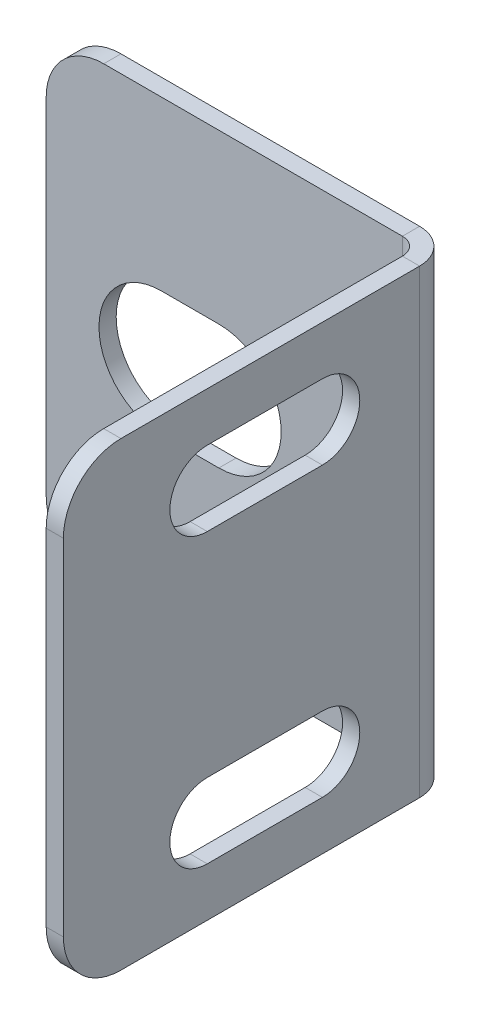
ISO-10303-21;
HEADER;
FILE_DESCRIPTION(('STEP AP214'),'2;1');
FILE_NAME('part.step','',(''),(''),'','','');
FILE_SCHEMA(('AUTOMOTIVE_DESIGN { 1 0 10303 214 1 1 1 1 }'));
ENDSEC;
DATA;
#1=APPLICATION_CONTEXT('core data for automotive mechanical design processes');
#2=APPLICATION_PROTOCOL_DEFINITION('international standard','automotive_design',2000,#1);
#3=PRODUCT_CONTEXT('',#1,'mechanical');
#4=PRODUCT('Part','Part','',(#3));
#5=PRODUCT_RELATED_PRODUCT_CATEGORY('part','',(#4));
#6=PRODUCT_DEFINITION_FORMATION('','',#4);
#7=PRODUCT_DEFINITION_CONTEXT('part definition',#1,'design');
#8=PRODUCT_DEFINITION('design','',#6,#7);
#9=PRODUCT_DEFINITION_SHAPE('','',#8);
#10=(LENGTH_UNIT() NAMED_UNIT(*) SI_UNIT(.MILLI.,.METRE.));
#11=(NAMED_UNIT(*) PLANE_ANGLE_UNIT() SI_UNIT($,.RADIAN.));
#12=(NAMED_UNIT(*) SI_UNIT($,.STERADIAN.) SOLID_ANGLE_UNIT());
#13=UNCERTAINTY_MEASURE_WITH_UNIT(LENGTH_MEASURE(1.E-05),#10,'distance_accuracy_value','');
#14=(GEOMETRIC_REPRESENTATION_CONTEXT(3) GLOBAL_UNCERTAINTY_ASSIGNED_CONTEXT((#13)) GLOBAL_UNIT_ASSIGNED_CONTEXT((#10,
#11,#12)) REPRESENTATION_CONTEXT('',''));
#15=CARTESIAN_POINT('',(0.,0.,0.));
#16=DIRECTION('',(0.,0.,1.));
#17=DIRECTION('',(1.,0.,0.));
#18=AXIS2_PLACEMENT_3D('',#15,#16,#17);
#19=CARTESIAN_POINT('',(-3.83615356006614,0.,4.54330643993387));
#20=DIRECTION('',(1.,0.,0.));
#21=DIRECTION('',(0.,0.,-1.));
#22=AXIS2_PLACEMENT_3D('',#19,#20,#21);
#23=PLANE('',#22);
#24=DIRECTION('',(0.,0.,1.));
#25=VECTOR('',#24,1.);
#26=CARTESIAN_POINT('',(-3.83615356006615,4.7,5.81330643993387));
#27=LINE('',#26,#25);
#28=CARTESIAN_POINT('',(-3.83615356006615,4.7,5.81330643993387));
#29=VERTEX_POINT('',#28);
#30=CARTESIAN_POINT('',(-3.83615356006616,4.7,10.8933064399339));
#31=VERTEX_POINT('',#30);
#32=EDGE_CURVE('E338',#29,#31,#27,.T.);
#33=ORIENTED_EDGE('',*,*,#32,.F.);
#34=CARTESIAN_POINT('',(-3.83615356006615,6.35,5.81330643993387));
#35=DIRECTION('',(-1.,0.,0.));
#36=DIRECTION('',(0.,0.,1.));
#37=AXIS2_PLACEMENT_3D('',#34,#35,#36);
#38=CIRCLE('',#37,1.65);
#39=CARTESIAN_POINT('',(-3.83615356006615,8.,5.81330643993387));
#40=VERTEX_POINT('',#39);
#41=EDGE_CURVE('E341',#40,#29,#38,.T.);
#42=ORIENTED_EDGE('',*,*,#41,.F.);
#43=DIRECTION('',(0.,0.,-1.));
#44=VECTOR('',#43,1.);
#45=CARTESIAN_POINT('',(-3.83615356006615,8.,5.81330643993387));
#46=LINE('',#45,#44);
#47=CARTESIAN_POINT('',(-3.83615356006616,8.,10.8933064399339));
#48=VERTEX_POINT('',#47);
#49=EDGE_CURVE('E344',#48,#40,#46,.T.);
#50=ORIENTED_EDGE('',*,*,#49,.F.);
#51=CARTESIAN_POINT('',(-3.83615356006616,6.35,10.8933064399339));
#52=DIRECTION('',(-1.,0.,0.));
#53=DIRECTION('',(0.,0.,1.));
#54=AXIS2_PLACEMENT_3D('',#51,#52,#53);
#55=CIRCLE('',#54,1.65);
#56=EDGE_CURVE('E347',#31,#48,#55,.T.);
#57=ORIENTED_EDGE('',*,*,#56,.F.);
#58=EDGE_LOOP('',(#33,#42,#50,#57));
#59=FACE_BOUND('',#58,.T.);
#60=DIRECTION('',(0.,0.,1.));
#61=VECTOR('',#60,1.);
#62=CARTESIAN_POINT('',(-3.83615356006614,-8.,5.81330643993386));
#63=LINE('',#62,#61);
#64=CARTESIAN_POINT('',(-3.83615356006614,-8.,5.81330643993386));
#65=VERTEX_POINT('',#64);
#66=CARTESIAN_POINT('',(-3.83615356006616,-8.,10.8933064399339));
#67=VERTEX_POINT('',#66);
#68=EDGE_CURVE('E326',#65,#67,#63,.T.);
#69=ORIENTED_EDGE('',*,*,#68,.F.);
#70=CARTESIAN_POINT('',(-3.83615356006614,-6.35,5.81330643993386));
#71=DIRECTION('',(-1.,0.,0.));
#72=DIRECTION('',(0.,0.,1.));
#73=AXIS2_PLACEMENT_3D('',#70,#71,#72);
#74=CIRCLE('',#73,1.65);
#75=CARTESIAN_POINT('',(-3.83615356006614,-4.7,5.81330643993387));
#76=VERTEX_POINT('',#75);
#77=EDGE_CURVE('E329',#76,#65,#74,.T.);
#78=ORIENTED_EDGE('',*,*,#77,.F.);
#79=DIRECTION('',(0.,0.,-1.));
#80=VECTOR('',#79,1.);
#81=CARTESIAN_POINT('',(-3.83615356006614,-4.7,5.81330643993387));
#82=LINE('',#81,#80);
#83=CARTESIAN_POINT('',(-3.83615356006616,-4.7,10.8933064399339));
#84=VERTEX_POINT('',#83);
#85=EDGE_CURVE('E332',#84,#76,#82,.T.);
#86=ORIENTED_EDGE('',*,*,#85,.F.);
#87=CARTESIAN_POINT('',(-3.83615356006616,-6.35,10.8933064399339));
#88=DIRECTION('',(-1.,0.,0.));
#89=DIRECTION('',(0.,0.,1.));
#90=AXIS2_PLACEMENT_3D('',#87,#88,#89);
#91=CIRCLE('',#90,1.65);
#92=EDGE_CURVE('E335',#67,#84,#91,.T.);
#93=ORIENTED_EDGE('',*,*,#92,.F.);
#94=EDGE_LOOP('',(#69,#78,#86,#93));
#95=FACE_BOUND('',#94,.T.);
#96=DIRECTION('',(0.,0.,-1.));
#97=VECTOR('',#96,1.);
#98=CARTESIAN_POINT('',(-3.83615356006619,10.16,17.2433064399339));
#99=LINE('',#98,#97);
#100=CARTESIAN_POINT('',(-3.83615356006618,10.16,14.7033064399339));
#101=VERTEX_POINT('',#100);
#102=CARTESIAN_POINT('',(-3.83615356006613,10.16,1.52146));
#103=VERTEX_POINT('',#102);
#104=EDGE_CURVE('E94',#101,#103,#99,.T.);
#105=ORIENTED_EDGE('',*,*,#104,.T.);
#106=DIRECTION('',(0.,-1.,0.));
#107=VECTOR('',#106,1.);
#108=CARTESIAN_POINT('',(-3.83615356006613,0.,1.52146));
#109=LINE('',#108,#107);
#110=CARTESIAN_POINT('',(-3.83615356006613,-10.16,1.52146));
#111=VERTEX_POINT('',#110);
#112=EDGE_CURVE('E275',#103,#111,#109,.T.);
#113=ORIENTED_EDGE('',*,*,#112,.T.);
#114=DIRECTION('',(0.,0.,1.));
#115=VECTOR('',#114,1.);
#116=CARTESIAN_POINT('',(-3.83615356006618,-10.16,17.2433064399339));
#117=LINE('',#116,#115);
#118=CARTESIAN_POINT('',(-3.83615356006618,-10.16,14.7033064399339));
#119=VERTEX_POINT('',#118);
#120=EDGE_CURVE('E350',#111,#119,#117,.T.);
#121=ORIENTED_EDGE('',*,*,#120,.T.);
#122=CARTESIAN_POINT('',(-3.83615356006618,-7.62,14.7033064399339));
#123=DIRECTION('',(1.,0.,0.));
#124=DIRECTION('',(0.,0.,-1.));
#125=AXIS2_PLACEMENT_3D('',#122,#123,#124);
#126=CIRCLE('',#125,2.54);
#127=CARTESIAN_POINT('',(-3.83615356006618,-7.62,17.2433064399339));
#128=VERTEX_POINT('',#127);
#129=EDGE_CURVE('E403',#119,#128,#126,.F.);
#130=ORIENTED_EDGE('',*,*,#129,.T.);
#131=DIRECTION('',(0.,1.,0.));
#132=VECTOR('',#131,1.);
#133=CARTESIAN_POINT('',(-3.83615356006619,10.16,17.2433064399339));
#134=LINE('',#133,#132);
#135=CARTESIAN_POINT('',(-3.83615356006619,7.62,17.2433064399339));
#136=VERTEX_POINT('',#135);
#137=EDGE_CURVE('E351',#128,#136,#134,.T.);
#138=ORIENTED_EDGE('',*,*,#137,.T.);
#139=CARTESIAN_POINT('',(-3.83615356006618,7.62,14.7033064399339));
#140=DIRECTION('',(1.,0.,0.));
#141=DIRECTION('',(0.,0.,-1.));
#142=AXIS2_PLACEMENT_3D('',#139,#140,#141);
#143=CIRCLE('',#142,2.54);
#144=EDGE_CURVE('E405',#136,#101,#143,.F.);
#145=ORIENTED_EDGE('',*,*,#144,.T.);
#146=EDGE_LOOP('',(#105,#113,#121,#130,#138,#145));
#147=FACE_BOUND('',#146,.T.);
#148=ADVANCED_FACE('F90',(#59,#95,#147),#23,.F.);
#149=CARTESIAN_POINT('',(-3.83615356006619,10.16,17.2433064399339));
#150=DIRECTION('',(0.,0.,-1.));
#151=DIRECTION('',(0.,1.,0.));
#152=AXIS2_PLACEMENT_3D('',#149,#150,#151);
#153=PLANE('',#152);
#154=DIRECTION('',(0.,1.,0.));
#155=VECTOR('',#154,1.);
#156=CARTESIAN_POINT('',(-3.07669356006619,0.,17.2433064399339));
#157=LINE('',#156,#155);
#158=CARTESIAN_POINT('',(-3.07669356006618,-7.62,17.2433064399339));
#159=VERTEX_POINT('',#158);
#160=CARTESIAN_POINT('',(-3.07669356006619,7.62,17.2433064399339));
#161=VERTEX_POINT('',#160);
#162=EDGE_CURVE('E379',#159,#161,#157,.T.);
#163=ORIENTED_EDGE('',*,*,#162,.T.);
#164=DIRECTION('',(1.,0.,0.));
#165=VECTOR('',#164,1.);
#166=CARTESIAN_POINT('',(-3.83615356006619,7.62,17.2433064399339));
#167=LINE('',#166,#165);
#168=EDGE_CURVE('E400',#161,#136,#167,.F.);
#169=ORIENTED_EDGE('',*,*,#168,.T.);
#170=ORIENTED_EDGE('',*,*,#137,.F.);
#171=DIRECTION('',(1.,0.,0.));
#172=VECTOR('',#171,1.);
#173=CARTESIAN_POINT('',(-3.83615356006618,-7.62,17.2433064399339));
#174=LINE('',#173,#172);
#175=EDGE_CURVE('E397',#128,#159,#174,.T.);
#176=ORIENTED_EDGE('',*,*,#175,.T.);
#177=EDGE_LOOP('',(#163,#169,#170,#176));
#178=FACE_BOUND('',#177,.T.);
#179=ADVANCED_FACE('F438',(#178),#153,.F.);
#180=CARTESIAN_POINT('',(-3.83615356006619,10.16,17.2433064399339));
#181=DIRECTION('',(0.,-1.,0.));
#182=DIRECTION('',(0.,0.,-1.));
#183=AXIS2_PLACEMENT_3D('',#180,#181,#182);
#184=PLANE('',#183);
#185=DIRECTION('',(1.,0.,0.));
#186=VECTOR('',#185,1.);
#187=CARTESIAN_POINT('',(-3.83615356006613,10.16,1.52146));
#188=LINE('',#187,#186);
#189=CARTESIAN_POINT('',(-3.07669356006613,10.16,1.52146000000001));
#190=VERTEX_POINT('',#189);
#191=EDGE_CURVE('E417',#103,#190,#188,.T.);
#192=ORIENTED_EDGE('',*,*,#191,.F.);
#193=ORIENTED_EDGE('',*,*,#104,.F.);
#194=DIRECTION('',(1.,0.,0.));
#195=VECTOR('',#194,1.);
#196=CARTESIAN_POINT('',(-3.83615356006618,10.16,14.7033064399339));
#197=LINE('',#196,#195);
#198=CARTESIAN_POINT('',(-3.07669356006618,10.16,14.7033064399339));
#199=VERTEX_POINT('',#198);
#200=EDGE_CURVE('E407',#101,#199,#197,.T.);
#201=ORIENTED_EDGE('',*,*,#200,.T.);
#202=DIRECTION('',(0.,0.,-1.));
#203=VECTOR('',#202,1.);
#204=CARTESIAN_POINT('',(-3.07669356006614,10.16,4.54330643993387));
#205=LINE('',#204,#203);
#206=EDGE_CURVE('E115',#199,#190,#205,.T.);
#207=ORIENTED_EDGE('',*,*,#206,.T.);
#208=EDGE_LOOP('',(#192,#193,#201,#207));
#209=FACE_BOUND('',#208,.T.);
#210=ADVANCED_FACE('F443',(#209),#184,.F.);
#211=CARTESIAN_POINT('',(-3.83615356006615,8.,5.81330643993387));
#212=DIRECTION('',(0.,-1.,0.));
#213=DIRECTION('',(0.,0.,-1.));
#214=AXIS2_PLACEMENT_3D('',#211,#212,#213);
#215=PLANE('',#214);
#216=DIRECTION('',(-1.,0.,0.));
#217=VECTOR('',#216,1.);
#218=CARTESIAN_POINT('',(-3.83615356006615,8.,5.81330643993387));
#219=LINE('',#218,#217);
#220=CARTESIAN_POINT('',(-3.07669356006615,8.,5.81330643993387));
#221=VERTEX_POINT('',#220);
#222=EDGE_CURVE('E395',#221,#40,#219,.T.);
#223=ORIENTED_EDGE('',*,*,#222,.F.);
#224=DIRECTION('',(0.,0.,-1.));
#225=VECTOR('',#224,1.);
#226=CARTESIAN_POINT('',(-3.07669356006614,8.,4.54330643993387));
#227=LINE('',#226,#225);
#228=CARTESIAN_POINT('',(-3.07669356006617,8.,10.8933064399339));
#229=VERTEX_POINT('',#228);
#230=EDGE_CURVE('E374',#229,#221,#227,.T.);
#231=ORIENTED_EDGE('',*,*,#230,.F.);
#232=DIRECTION('',(-1.,0.,0.));
#233=VECTOR('',#232,1.);
#234=CARTESIAN_POINT('',(-3.83615356006616,8.,10.8933064399339));
#235=LINE('',#234,#233);
#236=EDGE_CURVE('E393',#229,#48,#235,.T.);
#237=ORIENTED_EDGE('',*,*,#236,.T.);
#238=ORIENTED_EDGE('',*,*,#49,.T.);
#239=EDGE_LOOP('',(#223,#231,#237,#238));
#240=FACE_BOUND('',#239,.T.);
#241=ADVANCED_FACE('F525',(#240),#215,.T.);
#242=CARTESIAN_POINT('',(-3.83615356006616,6.35,10.8933064399339));
#243=DIRECTION('',(-1.,0.,0.));
#244=DIRECTION('',(0.,0.,1.));
#245=AXIS2_PLACEMENT_3D('',#242,#243,#244);
#246=CYLINDRICAL_SURFACE('',#245,1.65);
#247=ORIENTED_EDGE('',*,*,#236,.F.);
#248=CARTESIAN_POINT('',(-3.07669356006617,6.35,10.8933064399339));
#249=DIRECTION('',(-1.,0.,0.));
#250=DIRECTION('',(0.,0.,1.));
#251=AXIS2_PLACEMENT_3D('',#248,#249,#250);
#252=CIRCLE('',#251,1.65);
#253=CARTESIAN_POINT('',(-3.07669356006616,4.7,10.8933064399339));
#254=VERTEX_POINT('',#253);
#255=EDGE_CURVE('E371',#254,#229,#252,.T.);
#256=ORIENTED_EDGE('',*,*,#255,.F.);
#257=DIRECTION('',(-1.,0.,0.));
#258=VECTOR('',#257,1.);
#259=CARTESIAN_POINT('',(-3.83615356006616,4.7,10.8933064399339));
#260=LINE('',#259,#258);
#261=EDGE_CURVE('E391',#254,#31,#260,.T.);
#262=ORIENTED_EDGE('',*,*,#261,.T.);
#263=ORIENTED_EDGE('',*,*,#56,.T.);
#264=EDGE_LOOP('',(#247,#256,#262,#263));
#265=FACE_BOUND('',#264,.T.);
#266=ADVANCED_FACE('F548',(#265),#246,.F.);
#267=CARTESIAN_POINT('',(-3.83615356006615,4.7,5.81330643993387));
#268=DIRECTION('',(0.,1.,0.));
#269=DIRECTION('',(0.,0.,1.));
#270=AXIS2_PLACEMENT_3D('',#267,#268,#269);
#271=PLANE('',#270);
#272=ORIENTED_EDGE('',*,*,#261,.F.);
#273=DIRECTION('',(0.,0.,-1.));
#274=VECTOR('',#273,1.);
#275=CARTESIAN_POINT('',(-3.07669356006614,4.7,4.54330643993387));
#276=LINE('',#275,#274);
#277=CARTESIAN_POINT('',(-3.07669356006615,4.7,5.81330643993387));
#278=VERTEX_POINT('',#277);
#279=EDGE_CURVE('E362',#278,#254,#276,.F.);
#280=ORIENTED_EDGE('',*,*,#279,.F.);
#281=DIRECTION('',(-1.,0.,0.));
#282=VECTOR('',#281,1.);
#283=CARTESIAN_POINT('',(-3.83615356006615,4.7,5.81330643993387));
#284=LINE('',#283,#282);
#285=EDGE_CURVE('E389',#278,#29,#284,.T.);
#286=ORIENTED_EDGE('',*,*,#285,.T.);
#287=ORIENTED_EDGE('',*,*,#32,.T.);
#288=EDGE_LOOP('',(#272,#280,#286,#287));
#289=FACE_BOUND('',#288,.T.);
#290=ADVANCED_FACE('F552',(#289),#271,.T.);
#291=CARTESIAN_POINT('',(-3.83615356006614,-4.7,5.81330643993387));
#292=DIRECTION('',(0.,-1.,0.));
#293=DIRECTION('',(0.,0.,-1.));
#294=AXIS2_PLACEMENT_3D('',#291,#292,#293);
#295=PLANE('',#294);
#296=DIRECTION('',(-1.,0.,0.));
#297=VECTOR('',#296,1.);
#298=CARTESIAN_POINT('',(-3.83615356006614,-4.7,5.81330643993387));
#299=LINE('',#298,#297);
#300=CARTESIAN_POINT('',(-3.07669356006615,-4.7,5.81330643993387));
#301=VERTEX_POINT('',#300);
#302=EDGE_CURVE('E387',#301,#76,#299,.T.);
#303=ORIENTED_EDGE('',*,*,#302,.F.);
#304=DIRECTION('',(0.,0.,-1.));
#305=VECTOR('',#304,1.);
#306=CARTESIAN_POINT('',(-3.07669356006614,-4.7,4.54330643993387));
#307=LINE('',#306,#305);
#308=CARTESIAN_POINT('',(-3.07669356006616,-4.7,10.8933064399339));
#309=VERTEX_POINT('',#308);
#310=EDGE_CURVE('E363',#309,#301,#307,.T.);
#311=ORIENTED_EDGE('',*,*,#310,.F.);
#312=DIRECTION('',(-1.,0.,0.));
#313=VECTOR('',#312,1.);
#314=CARTESIAN_POINT('',(-3.83615356006616,-4.7,10.8933064399339));
#315=LINE('',#314,#313);
#316=EDGE_CURVE('E384',#309,#84,#315,.T.);
#317=ORIENTED_EDGE('',*,*,#316,.T.);
#318=ORIENTED_EDGE('',*,*,#85,.T.);
#319=EDGE_LOOP('',(#303,#311,#317,#318));
#320=FACE_BOUND('',#319,.T.);
#321=ADVANCED_FACE('F555',(#320),#295,.T.);
#322=CARTESIAN_POINT('',(-3.83615356006616,-6.35,10.8933064399339));
#323=DIRECTION('',(-1.,0.,0.));
#324=DIRECTION('',(0.,0.,1.));
#325=AXIS2_PLACEMENT_3D('',#322,#323,#324);
#326=CYLINDRICAL_SURFACE('',#325,1.65);
#327=ORIENTED_EDGE('',*,*,#316,.F.);
#328=CARTESIAN_POINT('',(-3.07669356006616,-6.35,10.8933064399339));
#329=DIRECTION('',(-1.,0.,0.));
#330=DIRECTION('',(0.,0.,1.));
#331=AXIS2_PLACEMENT_3D('',#328,#329,#330);
#332=CIRCLE('',#331,1.65);
#333=CARTESIAN_POINT('',(-3.07669356006616,-8.,10.8933064399339));
#334=VERTEX_POINT('',#333);
#335=EDGE_CURVE('E359',#334,#309,#332,.T.);
#336=ORIENTED_EDGE('',*,*,#335,.F.);
#337=DIRECTION('',(-1.,0.,0.));
#338=VECTOR('',#337,1.);
#339=CARTESIAN_POINT('',(-3.83615356006616,-8.,10.8933064399339));
#340=LINE('',#339,#338);
#341=EDGE_CURVE('E382',#334,#67,#340,.T.);
#342=ORIENTED_EDGE('',*,*,#341,.T.);
#343=ORIENTED_EDGE('',*,*,#92,.T.);
#344=EDGE_LOOP('',(#327,#336,#342,#343));
#345=FACE_BOUND('',#344,.T.);
#346=ADVANCED_FACE('F560',(#345),#326,.F.);
#347=CARTESIAN_POINT('',(-3.83615356006614,-8.,5.81330643993386));
#348=DIRECTION('',(0.,1.,0.));
#349=DIRECTION('',(0.,0.,1.));
#350=AXIS2_PLACEMENT_3D('',#347,#348,#349);
#351=PLANE('',#350);
#352=ORIENTED_EDGE('',*,*,#341,.F.);
#353=DIRECTION('',(0.,0.,-1.));
#354=VECTOR('',#353,1.);
#355=CARTESIAN_POINT('',(-3.07669356006614,-8.,4.54330643993387));
#356=LINE('',#355,#354);
#357=CARTESIAN_POINT('',(-3.07669356006614,-8.,5.81330643993387));
#358=VERTEX_POINT('',#357);
#359=EDGE_CURVE('E354',#358,#334,#356,.F.);
#360=ORIENTED_EDGE('',*,*,#359,.F.);
#361=DIRECTION('',(-1.,0.,0.));
#362=VECTOR('',#361,1.);
#363=CARTESIAN_POINT('',(-3.83615356006614,-8.,5.81330643993386));
#364=LINE('',#363,#362);
#365=EDGE_CURVE('E385',#358,#65,#364,.T.);
#366=ORIENTED_EDGE('',*,*,#365,.T.);
#367=ORIENTED_EDGE('',*,*,#68,.T.);
#368=EDGE_LOOP('',(#352,#360,#366,#367));
#369=FACE_BOUND('',#368,.T.);
#370=ADVANCED_FACE('F541',(#369),#351,.T.);
#371=CARTESIAN_POINT('',(-3.83615356006614,-6.35,5.81330643993386));
#372=DIRECTION('',(-1.,0.,0.));
#373=DIRECTION('',(0.,0.,1.));
#374=AXIS2_PLACEMENT_3D('',#371,#372,#373);
#375=CYLINDRICAL_SURFACE('',#374,1.65);
#376=CARTESIAN_POINT('',(-3.07669356006615,-6.35,5.81330643993387));
#377=DIRECTION('',(-1.,0.,0.));
#378=DIRECTION('',(0.,0.,1.));
#379=AXIS2_PLACEMENT_3D('',#376,#377,#378);
#380=CIRCLE('',#379,1.65);
#381=EDGE_CURVE('E357',#301,#358,#380,.T.);
#382=ORIENTED_EDGE('',*,*,#381,.F.);
#383=ORIENTED_EDGE('',*,*,#302,.T.);
#384=ORIENTED_EDGE('',*,*,#77,.T.);
#385=ORIENTED_EDGE('',*,*,#365,.F.);
#386=EDGE_LOOP('',(#382,#383,#384,#385));
#387=FACE_BOUND('',#386,.T.);
#388=ADVANCED_FACE('F535',(#387),#375,.F.);
#389=CARTESIAN_POINT('',(-3.83615356006615,6.35,5.81330643993387));
#390=DIRECTION('',(-1.,0.,0.));
#391=DIRECTION('',(0.,0.,1.));
#392=AXIS2_PLACEMENT_3D('',#389,#390,#391);
#393=CYLINDRICAL_SURFACE('',#392,1.65);
#394=CARTESIAN_POINT('',(-3.07669356006615,6.35,5.81330643993387));
#395=DIRECTION('',(-1.,0.,0.));
#396=DIRECTION('',(0.,0.,1.));
#397=AXIS2_PLACEMENT_3D('',#394,#395,#396);
#398=CIRCLE('',#397,1.65);
#399=EDGE_CURVE('E370',#221,#278,#398,.T.);
#400=ORIENTED_EDGE('',*,*,#399,.F.);
#401=ORIENTED_EDGE('',*,*,#222,.T.);
#402=ORIENTED_EDGE('',*,*,#41,.T.);
#403=ORIENTED_EDGE('',*,*,#285,.F.);
#404=EDGE_LOOP('',(#400,#401,#402,#403));
#405=FACE_BOUND('',#404,.T.);
#406=ADVANCED_FACE('F531',(#405),#393,.F.);
#407=CARTESIAN_POINT('',(-3.83615356006618,-10.16,17.2433064399339));
#408=DIRECTION('',(0.,1.,0.));
#409=DIRECTION('',(0.,0.,1.));
#410=AXIS2_PLACEMENT_3D('',#407,#408,#409);
#411=PLANE('',#410);
#412=DIRECTION('',(-1.,0.,0.));
#413=VECTOR('',#412,1.);
#414=CARTESIAN_POINT('',(-3.83615356006613,-10.16,1.52146));
#415=LINE('',#414,#413);
#416=CARTESIAN_POINT('',(-3.07669356006613,-10.16,1.52146));
#417=VERTEX_POINT('',#416);
#418=EDGE_CURVE('E12',#417,#111,#415,.T.);
#419=ORIENTED_EDGE('',*,*,#418,.F.);
#420=DIRECTION('',(0.,0.,-1.));
#421=VECTOR('',#420,1.);
#422=CARTESIAN_POINT('',(-3.07669356006614,-10.16,4.54330643993387));
#423=LINE('',#422,#421);
#424=CARTESIAN_POINT('',(-3.07669356006618,-10.16,14.7033064399339));
#425=VERTEX_POINT('',#424);
#426=EDGE_CURVE('E107',#417,#425,#423,.F.);
#427=ORIENTED_EDGE('',*,*,#426,.T.);
#428=DIRECTION('',(1.,0.,0.));
#429=VECTOR('',#428,1.);
#430=CARTESIAN_POINT('',(-3.83615356006618,-10.16,14.7033064399339));
#431=LINE('',#430,#429);
#432=EDGE_CURVE('E413',#425,#119,#431,.F.);
#433=ORIENTED_EDGE('',*,*,#432,.T.);
#434=ORIENTED_EDGE('',*,*,#120,.F.);
#435=EDGE_LOOP('',(#419,#427,#433,#434));
#436=FACE_BOUND('',#435,.T.);
#437=ADVANCED_FACE('F92',(#436),#411,.F.);
#438=CARTESIAN_POINT('',(-3.07669356006614,0.,4.54330643993387));
#439=DIRECTION('',(1.,0.,0.));
#440=DIRECTION('',(0.,0.,-1.));
#441=AXIS2_PLACEMENT_3D('',#438,#439,#440);
#442=PLANE('',#441);
#443=DIRECTION('',(0.,-1.,0.));
#444=VECTOR('',#443,1.);
#445=CARTESIAN_POINT('',(-3.07669356006613,0.,1.52146));
#446=LINE('',#445,#444);
#447=EDGE_CURVE('E99',#190,#417,#446,.T.);
#448=ORIENTED_EDGE('',*,*,#447,.F.);
#449=ORIENTED_EDGE('',*,*,#206,.F.);
#450=CARTESIAN_POINT('',(-3.07669356006618,7.62,14.7033064399339));
#451=DIRECTION('',(1.,0.,0.));
#452=DIRECTION('',(0.,0.,-1.));
#453=AXIS2_PLACEMENT_3D('',#450,#451,#452);
#454=CIRCLE('',#453,2.54);
#455=EDGE_CURVE('E411',#199,#161,#454,.T.);
#456=ORIENTED_EDGE('',*,*,#455,.T.);
#457=ORIENTED_EDGE('',*,*,#162,.F.);
#458=CARTESIAN_POINT('',(-3.07669356006618,-7.62,14.7033064399339));
#459=DIRECTION('',(1.,0.,0.));
#460=DIRECTION('',(0.,0.,-1.));
#461=AXIS2_PLACEMENT_3D('',#458,#459,#460);
#462=CIRCLE('',#461,2.54);
#463=EDGE_CURVE('E409',#159,#425,#462,.T.);
#464=ORIENTED_EDGE('',*,*,#463,.T.);
#465=ORIENTED_EDGE('',*,*,#426,.F.);
#466=EDGE_LOOP('',(#448,#449,#456,#457,#464,#465));
#467=FACE_BOUND('',#466,.T.);
#468=ORIENTED_EDGE('',*,*,#359,.T.);
#469=ORIENTED_EDGE('',*,*,#335,.T.);
#470=ORIENTED_EDGE('',*,*,#310,.T.);
#471=ORIENTED_EDGE('',*,*,#381,.T.);
#472=EDGE_LOOP('',(#468,#469,#470,#471));
#473=FACE_BOUND('',#472,.T.);
#474=ORIENTED_EDGE('',*,*,#279,.T.);
#475=ORIENTED_EDGE('',*,*,#255,.T.);
#476=ORIENTED_EDGE('',*,*,#230,.T.);
#477=ORIENTED_EDGE('',*,*,#399,.T.);
#478=EDGE_LOOP('',(#474,#475,#476,#477));
#479=FACE_BOUND('',#478,.T.);
#480=ADVANCED_FACE('F433',(#467,#473,#479),#442,.T.);
#481=CARTESIAN_POINT('',(-3.83615356006618,7.62,14.7033064399339));
#482=DIRECTION('',(-1.,0.,0.));
#483=DIRECTION('',(0.,0.,1.));
#484=AXIS2_PLACEMENT_3D('',#481,#482,#483);
#485=CYLINDRICAL_SURFACE('',#484,2.54);
#486=ORIENTED_EDGE('',*,*,#455,.F.);
#487=ORIENTED_EDGE('',*,*,#200,.F.);
#488=ORIENTED_EDGE('',*,*,#144,.F.);
#489=ORIENTED_EDGE('',*,*,#168,.F.);
#490=EDGE_LOOP('',(#486,#487,#488,#489));
#491=FACE_BOUND('',#490,.T.);
#492=ADVANCED_FACE('F440',(#491),#485,.T.);
#493=CARTESIAN_POINT('',(-3.83615356006618,-7.62,14.7033064399339));
#494=DIRECTION('',(-1.,0.,0.));
#495=DIRECTION('',(0.,0.,1.));
#496=AXIS2_PLACEMENT_3D('',#493,#494,#495);
#497=CYLINDRICAL_SURFACE('',#496,2.54);
#498=ORIENTED_EDGE('',*,*,#463,.F.);
#499=ORIENTED_EDGE('',*,*,#175,.F.);
#500=ORIENTED_EDGE('',*,*,#129,.F.);
#501=ORIENTED_EDGE('',*,*,#432,.F.);
#502=EDGE_LOOP('',(#498,#499,#500,#501));
#503=FACE_BOUND('',#502,.T.);
#504=ADVANCED_FACE('F430',(#503),#497,.T.);
#505=CARTESIAN_POINT('',(-12.7,0.,0.75946));
#506=DIRECTION('',(0.,0.,1.));
#507=DIRECTION('',(1.,0.,0.));
#508=AXIS2_PLACEMENT_3D('',#505,#506,#507);
#509=CYLINDRICAL_SURFACE('',#508,2.75);
#510=DIRECTION('',(0.,0.,1.));
#511=VECTOR('',#510,1.);
#512=CARTESIAN_POINT('',(-12.7,2.75,0.75946));
#513=LINE('',#512,#511);
#514=CARTESIAN_POINT('',(-12.7,2.75,0.));
#515=VERTEX_POINT('',#514);
#516=CARTESIAN_POINT('',(-12.7,2.75,0.75946));
#517=VERTEX_POINT('',#516);
#518=EDGE_CURVE('E320',#515,#517,#513,.T.);
#519=ORIENTED_EDGE('',*,*,#518,.F.);
#520=CARTESIAN_POINT('',(-12.7,0.,0.));
#521=DIRECTION('',(0.,0.,1.));
#522=DIRECTION('',(1.,0.,0.));
#523=AXIS2_PLACEMENT_3D('',#520,#521,#522);
#524=CIRCLE('',#523,2.75);
#525=CARTESIAN_POINT('',(-12.7,-2.75,0.));
#526=VERTEX_POINT('',#525);
#527=EDGE_CURVE('E472',#526,#515,#524,.T.);
#528=ORIENTED_EDGE('',*,*,#527,.F.);
#529=DIRECTION('',(0.,0.,1.));
#530=VECTOR('',#529,1.);
#531=CARTESIAN_POINT('',(-12.7,-2.75,0.75946));
#532=LINE('',#531,#530);
#533=CARTESIAN_POINT('',(-12.7,-2.75,0.75946));
#534=VERTEX_POINT('',#533);
#535=EDGE_CURVE('E287',#526,#534,#532,.T.);
#536=ORIENTED_EDGE('',*,*,#535,.T.);
#537=CARTESIAN_POINT('',(-12.7,0.,0.75946));
#538=DIRECTION('',(0.,0.,1.));
#539=DIRECTION('',(1.,0.,0.));
#540=AXIS2_PLACEMENT_3D('',#537,#538,#539);
#541=CIRCLE('',#540,2.75);
#542=EDGE_CURVE('E322',#534,#517,#541,.T.);
#543=ORIENTED_EDGE('',*,*,#542,.T.);
#544=EDGE_LOOP('',(#519,#528,#536,#543));
#545=FACE_BOUND('',#544,.T.);
#546=ADVANCED_FACE('F594',(#545),#509,.F.);
#547=CARTESIAN_POINT('',(-15.24,2.75,0.75946));
#548=DIRECTION('',(0.,-1.,0.));
#549=DIRECTION('',(-1.,0.,0.));
#550=AXIS2_PLACEMENT_3D('',#547,#548,#549);
#551=PLANE('',#550);
#552=DIRECTION('',(0.,0.,1.));
#553=VECTOR('',#552,1.);
#554=CARTESIAN_POINT('',(-15.24,2.75,0.75946));
#555=LINE('',#554,#553);
#556=CARTESIAN_POINT('',(-15.24,2.75,0.));
#557=VERTEX_POINT('',#556);
#558=CARTESIAN_POINT('',(-15.24,2.75,0.75946));
#559=VERTEX_POINT('',#558);
#560=EDGE_CURVE('E315',#557,#559,#555,.T.);
#561=ORIENTED_EDGE('',*,*,#560,.F.);
#562=DIRECTION('',(-1.,0.,0.));
#563=VECTOR('',#562,1.);
#564=CARTESIAN_POINT('',(0.,2.75,0.));
#565=LINE('',#564,#563);
#566=EDGE_CURVE('E469',#515,#557,#565,.T.);
#567=ORIENTED_EDGE('',*,*,#566,.F.);
#568=ORIENTED_EDGE('',*,*,#518,.T.);
#569=DIRECTION('',(-1.,0.,0.));
#570=VECTOR('',#569,1.);
#571=CARTESIAN_POINT('',(-15.24,2.75,0.75946));
#572=LINE('',#571,#570);
#573=EDGE_CURVE('E317',#517,#559,#572,.T.);
#574=ORIENTED_EDGE('',*,*,#573,.T.);
#575=EDGE_LOOP('',(#561,#567,#568,#574));
#576=FACE_BOUND('',#575,.T.);
#577=ADVANCED_FACE('F590',(#576),#551,.T.);
#578=CARTESIAN_POINT('',(-15.24,0.,0.75946));
#579=DIRECTION('',(0.,0.,1.));
#580=DIRECTION('',(1.,0.,0.));
#581=AXIS2_PLACEMENT_3D('',#578,#579,#580);
#582=CYLINDRICAL_SURFACE('',#581,2.75);
#583=CARTESIAN_POINT('',(-15.24,0.,0.));
#584=DIRECTION('',(0.,0.,1.));
#585=DIRECTION('',(1.,0.,0.));
#586=AXIS2_PLACEMENT_3D('',#583,#584,#585);
#587=CIRCLE('',#586,2.75);
#588=CARTESIAN_POINT('',(-15.24,-2.75,0.));
#589=VERTEX_POINT('',#588);
#590=EDGE_CURVE('E466',#557,#589,#587,.T.);
#591=ORIENTED_EDGE('',*,*,#590,.F.);
#592=ORIENTED_EDGE('',*,*,#560,.T.);
#593=CARTESIAN_POINT('',(-15.24,0.,0.75946));
#594=DIRECTION('',(0.,0.,1.));
#595=DIRECTION('',(1.,0.,0.));
#596=AXIS2_PLACEMENT_3D('',#593,#594,#595);
#597=CIRCLE('',#596,2.75);
#598=CARTESIAN_POINT('',(-15.24,-2.75,0.75946));
#599=VERTEX_POINT('',#598);
#600=EDGE_CURVE('E312',#559,#599,#597,.T.);
#601=ORIENTED_EDGE('',*,*,#600,.T.);
#602=DIRECTION('',(0.,0.,1.));
#603=VECTOR('',#602,1.);
#604=CARTESIAN_POINT('',(-15.24,-2.75,0.75946));
#605=LINE('',#604,#603);
#606=EDGE_CURVE('E310',#589,#599,#605,.T.);
#607=ORIENTED_EDGE('',*,*,#606,.F.);
#608=EDGE_LOOP('',(#591,#592,#601,#607));
#609=FACE_BOUND('',#608,.T.);
#610=ADVANCED_FACE('F586',(#609),#582,.F.);
#611=CARTESIAN_POINT('',(-15.24,-2.75,0.75946));
#612=DIRECTION('',(0.,1.,0.));
#613=DIRECTION('',(1.,0.,0.));
#614=AXIS2_PLACEMENT_3D('',#611,#612,#613);
#615=PLANE('',#614);
#616=ORIENTED_EDGE('',*,*,#535,.F.);
#617=DIRECTION('',(-1.,0.,0.));
#618=VECTOR('',#617,1.);
#619=CARTESIAN_POINT('',(0.,-2.75,0.));
#620=LINE('',#619,#618);
#621=EDGE_CURVE('E475',#589,#526,#620,.F.);
#622=ORIENTED_EDGE('',*,*,#621,.F.);
#623=ORIENTED_EDGE('',*,*,#606,.T.);
#624=DIRECTION('',(1.,0.,0.));
#625=VECTOR('',#624,1.);
#626=CARTESIAN_POINT('',(-15.24,-2.75,0.75946));
#627=LINE('',#626,#625);
#628=EDGE_CURVE('E307',#599,#534,#627,.T.);
#629=ORIENTED_EDGE('',*,*,#628,.T.);
#630=EDGE_LOOP('',(#616,#622,#623,#629));
#631=FACE_BOUND('',#630,.T.);
#632=ADVANCED_FACE('F583',(#631),#615,.T.);
#633=CARTESIAN_POINT('',(-17.78,-7.62,0.75946));
#634=DIRECTION('',(0.,0.,1.));
#635=DIRECTION('',(1.,0.,0.));
#636=AXIS2_PLACEMENT_3D('',#633,#634,#635);
#637=CYLINDRICAL_SURFACE('',#636,2.54);
#638=CARTESIAN_POINT('',(-17.78,-7.62,0.));
#639=DIRECTION('',(0.,0.,-1.));
#640=DIRECTION('',(-1.,0.,0.));
#641=AXIS2_PLACEMENT_3D('',#638,#639,#640);
#642=CIRCLE('',#641,2.54);
#643=CARTESIAN_POINT('',(-17.78,-10.16,0.));
#644=VERTEX_POINT('',#643);
#645=CARTESIAN_POINT('',(-20.32,-7.62,0.));
#646=VERTEX_POINT('',#645);
#647=EDGE_CURVE('E463',#644,#646,#642,.T.);
#648=ORIENTED_EDGE('',*,*,#647,.F.);
#649=DIRECTION('',(0.,0.,-1.));
#650=VECTOR('',#649,1.);
#651=CARTESIAN_POINT('',(-17.78,-10.16,0.75946));
#652=LINE('',#651,#650);
#653=CARTESIAN_POINT('',(-17.78,-10.16,0.75946));
#654=VERTEX_POINT('',#653);
#655=EDGE_CURVE('E358',#654,#644,#652,.T.);
#656=ORIENTED_EDGE('',*,*,#655,.F.);
#657=CARTESIAN_POINT('',(-17.78,-7.62,0.75946));
#658=DIRECTION('',(0.,0.,-1.));
#659=DIRECTION('',(-1.,0.,0.));
#660=AXIS2_PLACEMENT_3D('',#657,#658,#659);
#661=CIRCLE('',#660,2.54);
#662=CARTESIAN_POINT('',(-20.32,-7.62,0.75946));
#663=VERTEX_POINT('',#662);
#664=EDGE_CURVE('E481',#663,#654,#661,.F.);
#665=ORIENTED_EDGE('',*,*,#664,.F.);
#666=DIRECTION('',(0.,0.,-1.));
#667=VECTOR('',#666,1.);
#668=CARTESIAN_POINT('',(-20.32,-7.62,0.75946));
#669=LINE('',#668,#667);
#670=EDGE_CURVE('E298',#646,#663,#669,.F.);
#671=ORIENTED_EDGE('',*,*,#670,.F.);
#672=EDGE_LOOP('',(#648,#656,#665,#671));
#673=FACE_BOUND('',#672,.T.);
#674=ADVANCED_FACE('F497',(#673),#637,.T.);
#675=CARTESIAN_POINT('',(-20.32,10.16,0.75946));
#676=DIRECTION('',(1.,0.,0.));
#677=DIRECTION('',(0.,-1.,0.));
#678=AXIS2_PLACEMENT_3D('',#675,#676,#677);
#679=PLANE('',#678);
#680=DIRECTION('',(0.,1.,0.));
#681=VECTOR('',#680,1.);
#682=CARTESIAN_POINT('',(-20.32,0.,0.));
#683=LINE('',#682,#681);
#684=CARTESIAN_POINT('',(-20.32,7.62,0.));
#685=VERTEX_POINT('',#684);
#686=EDGE_CURVE('E304',#685,#646,#683,.F.);
#687=ORIENTED_EDGE('',*,*,#686,.T.);
#688=ORIENTED_EDGE('',*,*,#670,.T.);
#689=DIRECTION('',(0.,-1.,0.));
#690=VECTOR('',#689,1.);
#691=CARTESIAN_POINT('',(-20.32,10.16,0.75946));
#692=LINE('',#691,#690);
#693=CARTESIAN_POINT('',(-20.32,7.62,0.75946));
#694=VERTEX_POINT('',#693);
#695=EDGE_CURVE('E296',#694,#663,#692,.T.);
#696=ORIENTED_EDGE('',*,*,#695,.F.);
#697=DIRECTION('',(0.,0.,-1.));
#698=VECTOR('',#697,1.);
#699=CARTESIAN_POINT('',(-20.32,7.62,0.75946));
#700=LINE('',#699,#698);
#701=EDGE_CURVE('E294',#694,#685,#700,.T.);
#702=ORIENTED_EDGE('',*,*,#701,.T.);
#703=EDGE_LOOP('',(#687,#688,#696,#702));
#704=FACE_BOUND('',#703,.T.);
#705=ADVANCED_FACE('F486',(#704),#679,.F.);
#706=CARTESIAN_POINT('',(-17.78,7.62,0.75946));
#707=DIRECTION('',(0.,0.,1.));
#708=DIRECTION('',(1.,0.,0.));
#709=AXIS2_PLACEMENT_3D('',#706,#707,#708);
#710=CYLINDRICAL_SURFACE('',#709,2.54);
#711=CARTESIAN_POINT('',(-17.78,7.62,0.));
#712=DIRECTION('',(0.,0.,-1.));
#713=DIRECTION('',(-1.,0.,0.));
#714=AXIS2_PLACEMENT_3D('',#711,#712,#713);
#715=CIRCLE('',#714,2.54);
#716=CARTESIAN_POINT('',(-17.78,10.16,0.));
#717=VERTEX_POINT('',#716);
#718=EDGE_CURVE('E460',#685,#717,#715,.T.);
#719=ORIENTED_EDGE('',*,*,#718,.F.);
#720=ORIENTED_EDGE('',*,*,#701,.F.);
#721=CARTESIAN_POINT('',(-17.78,7.62,0.75946));
#722=DIRECTION('',(0.,0.,-1.));
#723=DIRECTION('',(-1.,0.,0.));
#724=AXIS2_PLACEMENT_3D('',#721,#722,#723);
#725=CIRCLE('',#724,2.54);
#726=CARTESIAN_POINT('',(-17.78,10.16,0.75946));
#727=VERTEX_POINT('',#726);
#728=EDGE_CURVE('E293',#727,#694,#725,.F.);
#729=ORIENTED_EDGE('',*,*,#728,.F.);
#730=DIRECTION('',(0.,0.,-1.));
#731=VECTOR('',#730,1.);
#732=CARTESIAN_POINT('',(-17.78,10.16,0.75946));
#733=LINE('',#732,#731);
#734=EDGE_CURVE('E292',#717,#727,#733,.F.);
#735=ORIENTED_EDGE('',*,*,#734,.F.);
#736=EDGE_LOOP('',(#719,#720,#729,#735));
#737=FACE_BOUND('',#736,.T.);
#738=ADVANCED_FACE('F491',(#737),#710,.T.);
#739=CARTESIAN_POINT('',(0.,0.,0.75946));
#740=DIRECTION('',(0.,0.,-1.));
#741=DIRECTION('',(-1.,0.,0.));
#742=AXIS2_PLACEMENT_3D('',#739,#740,#741);
#743=PLANE('',#742);
#744=DIRECTION('',(0.,-1.,0.));
#745=VECTOR('',#744,1.);
#746=CARTESIAN_POINT('',(-4.59815356006613,0.,0.75946));
#747=LINE('',#746,#745);
#748=CARTESIAN_POINT('',(-4.59815356006613,10.16,0.75946));
#749=VERTEX_POINT('',#748);
#750=CARTESIAN_POINT('',(-4.59815356006613,-10.16,0.75946));
#751=VERTEX_POINT('',#750);
#752=EDGE_CURVE('E272',#749,#751,#747,.T.);
#753=ORIENTED_EDGE('',*,*,#752,.F.);
#754=DIRECTION('',(-1.,0.,0.));
#755=VECTOR('',#754,1.);
#756=CARTESIAN_POINT('',(12.7,10.16,0.75946));
#757=LINE('',#756,#755);
#758=EDGE_CURVE('E283',#749,#727,#757,.T.);
#759=ORIENTED_EDGE('',*,*,#758,.T.);
#760=ORIENTED_EDGE('',*,*,#728,.T.);
#761=ORIENTED_EDGE('',*,*,#695,.T.);
#762=ORIENTED_EDGE('',*,*,#664,.T.);
#763=DIRECTION('',(1.,0.,0.));
#764=VECTOR('',#763,1.);
#765=CARTESIAN_POINT('',(12.7,-10.16,0.75946));
#766=LINE('',#765,#764);
#767=EDGE_CURVE('E266',#654,#751,#766,.T.);
#768=ORIENTED_EDGE('',*,*,#767,.T.);
#769=EDGE_LOOP('',(#753,#759,#760,#761,#762,#768));
#770=FACE_BOUND('',#769,.T.);
#771=ORIENTED_EDGE('',*,*,#628,.F.);
#772=ORIENTED_EDGE('',*,*,#600,.F.);
#773=ORIENTED_EDGE('',*,*,#573,.F.);
#774=ORIENTED_EDGE('',*,*,#542,.F.);
#775=EDGE_LOOP('',(#771,#772,#773,#774));
#776=FACE_BOUND('',#775,.T.);
#777=ADVANCED_FACE('F281',(#770,#776),#743,.F.);
#778=CARTESIAN_POINT('',(12.7,10.16,0.75946));
#779=DIRECTION('',(0.,-1.,0.));
#780=DIRECTION('',(-1.,0.,0.));
#781=AXIS2_PLACEMENT_3D('',#778,#779,#780);
#782=PLANE('',#781);
#783=ORIENTED_EDGE('',*,*,#758,.F.);
#784=DIRECTION('',(0.,0.,-1.));
#785=VECTOR('',#784,1.);
#786=CARTESIAN_POINT('',(-4.59815356006614,10.16,0.75946));
#787=LINE('',#786,#785);
#788=CARTESIAN_POINT('',(-4.59815356006614,10.16,0.));
#789=VERTEX_POINT('',#788);
#790=EDGE_CURVE('E254',#749,#789,#787,.T.);
#791=ORIENTED_EDGE('',*,*,#790,.T.);
#792=DIRECTION('',(-1.,0.,0.));
#793=VECTOR('',#792,1.);
#794=CARTESIAN_POINT('',(0.,10.16,0.));
#795=LINE('',#794,#793);
#796=EDGE_CURVE('E265',#789,#717,#795,.T.);
#797=ORIENTED_EDGE('',*,*,#796,.T.);
#798=ORIENTED_EDGE('',*,*,#734,.T.);
#799=EDGE_LOOP('',(#783,#791,#797,#798));
#800=FACE_BOUND('',#799,.T.);
#801=ADVANCED_FACE('F290',(#800),#782,.F.);
#802=CARTESIAN_POINT('',(0.,0.,0.));
#803=DIRECTION('',(0.,0.,-1.));
#804=DIRECTION('',(-1.,0.,0.));
#805=AXIS2_PLACEMENT_3D('',#802,#803,#804);
#806=PLANE('',#805);
#807=ORIENTED_EDGE('',*,*,#621,.T.);
#808=ORIENTED_EDGE('',*,*,#527,.T.);
#809=ORIENTED_EDGE('',*,*,#566,.T.);
#810=ORIENTED_EDGE('',*,*,#590,.T.);
#811=EDGE_LOOP('',(#807,#808,#809,#810));
#812=FACE_BOUND('',#811,.T.);
#813=ORIENTED_EDGE('',*,*,#796,.F.);
#814=DIRECTION('',(0.,-1.,0.));
#815=VECTOR('',#814,1.);
#816=CARTESIAN_POINT('',(-4.59815356006613,0.,0.));
#817=LINE('',#816,#815);
#818=CARTESIAN_POINT('',(-4.59815356006613,-10.16,0.));
#819=VERTEX_POINT('',#818);
#820=EDGE_CURVE('E448',#789,#819,#817,.T.);
#821=ORIENTED_EDGE('',*,*,#820,.T.);
#822=DIRECTION('',(-1.,0.,0.));
#823=VECTOR('',#822,1.);
#824=CARTESIAN_POINT('',(0.,-10.16,0.));
#825=LINE('',#824,#823);
#826=EDGE_CURVE('E457',#644,#819,#825,.F.);
#827=ORIENTED_EDGE('',*,*,#826,.F.);
#828=ORIENTED_EDGE('',*,*,#647,.T.);
#829=ORIENTED_EDGE('',*,*,#686,.F.);
#830=ORIENTED_EDGE('',*,*,#718,.T.);
#831=EDGE_LOOP('',(#813,#821,#827,#828,#829,#830));
#832=FACE_BOUND('',#831,.T.);
#833=ADVANCED_FACE('F493',(#812,#832),#806,.T.);
#834=CARTESIAN_POINT('',(12.7,-10.16,0.75946));
#835=DIRECTION('',(0.,1.,0.));
#836=DIRECTION('',(1.,0.,0.));
#837=AXIS2_PLACEMENT_3D('',#834,#835,#836);
#838=PLANE('',#837);
#839=ORIENTED_EDGE('',*,*,#826,.T.);
#840=DIRECTION('',(0.,0.,1.));
#841=VECTOR('',#840,1.);
#842=CARTESIAN_POINT('',(-4.59815356006613,-10.16,0.75946));
#843=LINE('',#842,#841);
#844=EDGE_CURVE('E455',#819,#751,#843,.T.);
#845=ORIENTED_EDGE('',*,*,#844,.T.);
#846=ORIENTED_EDGE('',*,*,#767,.F.);
#847=ORIENTED_EDGE('',*,*,#655,.T.);
#848=EDGE_LOOP('',(#839,#845,#846,#847));
#849=FACE_BOUND('',#848,.T.);
#850=ADVANCED_FACE('F500',(#849),#838,.F.);
#851=CARTESIAN_POINT('',(-4.59815356006613,10.16,1.52146));
#852=DIRECTION('',(0.,-1.,0.));
#853=DIRECTION('',(0.,0.,-1.));
#854=AXIS2_PLACEMENT_3D('',#851,#852,#853);
#855=PLANE('',#854);
#856=ORIENTED_EDGE('',*,*,#191,.T.);
#857=CARTESIAN_POINT('',(-4.59815356006613,10.16,1.52146));
#858=DIRECTION('',(0.,1.,0.));
#859=DIRECTION('',(-1.,0.,0.));
#860=AXIS2_PLACEMENT_3D('',#857,#858,#859);
#861=CIRCLE('',#860,1.52146);
#862=EDGE_CURVE('E261',#190,#789,#861,.T.);
#863=ORIENTED_EDGE('',*,*,#862,.T.);
#864=ORIENTED_EDGE('',*,*,#790,.F.);
#865=CARTESIAN_POINT('',(-4.59815356006613,10.16,1.52146));
#866=DIRECTION('',(0.,1.,0.));
#867=DIRECTION('',(0.,0.,1.));
#868=AXIS2_PLACEMENT_3D('',#865,#866,#867);
#869=CIRCLE('',#868,0.762);
#870=EDGE_CURVE('E258',#103,#749,#869,.T.);
#871=ORIENTED_EDGE('',*,*,#870,.F.);
#872=EDGE_LOOP('',(#856,#863,#864,#871));
#873=FACE_BOUND('',#872,.T.);
#874=ADVANCED_FACE('F257',(#873),#855,.F.);
#875=CARTESIAN_POINT('',(-4.59815356006613,-10.16,1.52146));
#876=DIRECTION('',(0.,1.,0.));
#877=DIRECTION('',(0.,0.,1.));
#878=AXIS2_PLACEMENT_3D('',#875,#876,#877);
#879=PLANE('',#878);
#880=ORIENTED_EDGE('',*,*,#844,.F.);
#881=CARTESIAN_POINT('',(-4.59815356006613,-10.16,1.52146));
#882=DIRECTION('',(0.,1.,0.));
#883=DIRECTION('',(-1.,0.,0.));
#884=AXIS2_PLACEMENT_3D('',#881,#882,#883);
#885=CIRCLE('',#884,1.52146);
#886=EDGE_CURVE('E277',#819,#417,#885,.F.);
#887=ORIENTED_EDGE('',*,*,#886,.T.);
#888=ORIENTED_EDGE('',*,*,#418,.T.);
#889=CARTESIAN_POINT('',(-4.59815356006613,-10.16,1.52146));
#890=DIRECTION('',(0.,-1.,0.));
#891=DIRECTION('',(0.,0.,-1.));
#892=AXIS2_PLACEMENT_3D('',#889,#890,#891);
#893=CIRCLE('',#892,0.762);
#894=EDGE_CURVE('E276',#751,#111,#893,.T.);
#895=ORIENTED_EDGE('',*,*,#894,.F.);
#896=EDGE_LOOP('',(#880,#887,#888,#895));
#897=FACE_BOUND('',#896,.T.);
#898=ADVANCED_FACE('F502',(#897),#879,.F.);
#899=CARTESIAN_POINT('',(-4.59815356006613,-20.3951936403796,1.52146));
#900=DIRECTION('',(0.,1.,0.));
#901=DIRECTION('',(-1.,0.,0.));
#902=AXIS2_PLACEMENT_3D('',#899,#900,#901);
#903=CYLINDRICAL_SURFACE('',#902,0.762);
#904=ORIENTED_EDGE('',*,*,#894,.T.);
#905=ORIENTED_EDGE('',*,*,#112,.F.);
#906=ORIENTED_EDGE('',*,*,#870,.T.);
#907=ORIENTED_EDGE('',*,*,#752,.T.);
#908=EDGE_LOOP('',(#904,#905,#906,#907));
#909=FACE_BOUND('',#908,.T.);
#910=ADVANCED_FACE('F271',(#909),#903,.F.);
#911=CARTESIAN_POINT('',(-4.59815356006613,-20.3951936403796,1.52146));
#912=DIRECTION('',(0.,1.,0.));
#913=DIRECTION('',(-1.,0.,0.));
#914=AXIS2_PLACEMENT_3D('',#911,#912,#913);
#915=CYLINDRICAL_SURFACE('',#914,1.52146);
#916=ORIENTED_EDGE('',*,*,#886,.F.);
#917=ORIENTED_EDGE('',*,*,#820,.F.);
#918=ORIENTED_EDGE('',*,*,#862,.F.);
#919=ORIENTED_EDGE('',*,*,#447,.T.);
#920=EDGE_LOOP('',(#916,#917,#918,#919));
#921=FACE_BOUND('',#920,.T.);
#922=ADVANCED_FACE('F446',(#921),#915,.T.);
#923=CLOSED_SHELL('',(#148,#179,#210,#241,#266,#290,#321,#346,#370,#388,#406,#437,#480,#492,
#504,#546,#577,#610,#632,#674,#705,#738,#777,#801,#833,#850,#874,#898,#910,#922));
#924=MANIFOLD_SOLID_BREP('B2',#923);
#925=ADVANCED_BREP_SHAPE_REPRESENTATION('',(#18,#924),#14);
#926=SHAPE_DEFINITION_REPRESENTATION(#9,#925);
ENDSEC;
END-ISO-10303-21;
